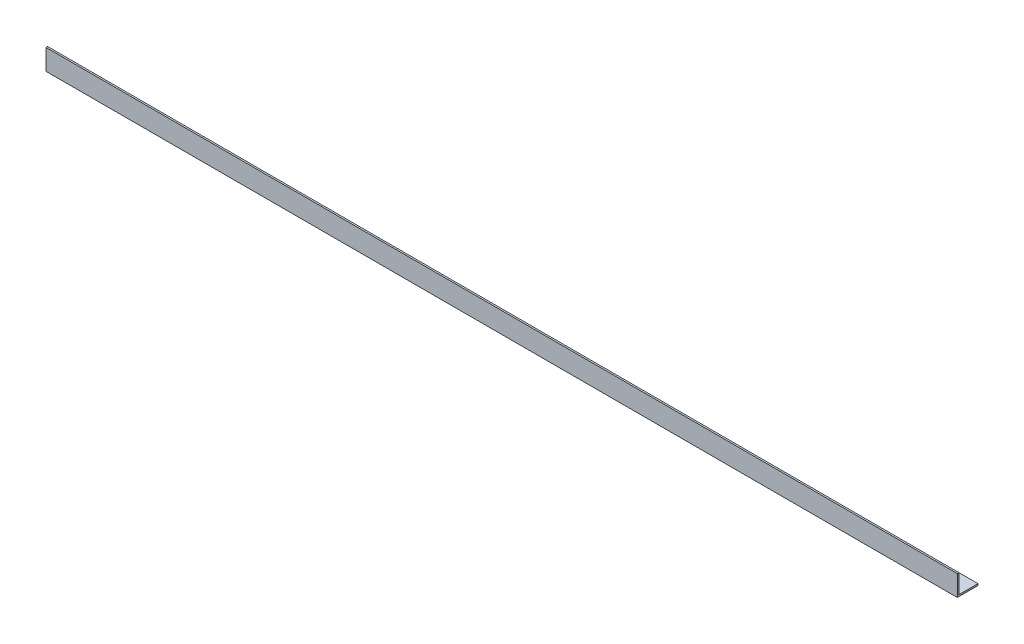
ISO-10303-21;
HEADER;
FILE_DESCRIPTION(('STEP AP214'),'2;1');
FILE_NAME('part.step','',(''),(''),'','','');
FILE_SCHEMA(('AUTOMOTIVE_DESIGN { 1 0 10303 214 1 1 1 1 }'));
ENDSEC;
DATA;
#1=APPLICATION_CONTEXT('core data for automotive mechanical design processes');
#2=APPLICATION_PROTOCOL_DEFINITION('international standard','automotive_design',2000,#1);
#3=PRODUCT_CONTEXT('',#1,'mechanical');
#4=PRODUCT('Part','Part','',(#3));
#5=PRODUCT_RELATED_PRODUCT_CATEGORY('part','',(#4));
#6=PRODUCT_DEFINITION_FORMATION('','',#4);
#7=PRODUCT_DEFINITION_CONTEXT('part definition',#1,'design');
#8=PRODUCT_DEFINITION('design','',#6,#7);
#9=PRODUCT_DEFINITION_SHAPE('','',#8);
#10=(LENGTH_UNIT() NAMED_UNIT(*) SI_UNIT(.MILLI.,.METRE.));
#11=(NAMED_UNIT(*) PLANE_ANGLE_UNIT() SI_UNIT($,.RADIAN.));
#12=(NAMED_UNIT(*) SI_UNIT($,.STERADIAN.) SOLID_ANGLE_UNIT());
#13=UNCERTAINTY_MEASURE_WITH_UNIT(LENGTH_MEASURE(1.E-05),#10,'distance_accuracy_value','');
#14=(GEOMETRIC_REPRESENTATION_CONTEXT(3) GLOBAL_UNCERTAINTY_ASSIGNED_CONTEXT((#13)) GLOBAL_UNIT_ASSIGNED_CONTEXT((#10,
#11,#12)) REPRESENTATION_CONTEXT('',''));
#15=CARTESIAN_POINT('',(0.,0.,0.));
#16=DIRECTION('',(0.,0.,1.));
#17=DIRECTION('',(1.,0.,0.));
#18=AXIS2_PLACEMENT_3D('',#15,#16,#17);
#19=CARTESIAN_POINT('',(1660.,0.,0.));
#20=DIRECTION('',(0.,1.,0.));
#21=DIRECTION('',(0.,0.,1.));
#22=AXIS2_PLACEMENT_3D('',#19,#20,#21);
#23=PLANE('',#22);
#24=DIRECTION('',(0.,0.,-1.));
#25=VECTOR('',#24,1.);
#26=CARTESIAN_POINT('',(0.,0.,0.));
#27=LINE('',#26,#25);
#28=CARTESIAN_POINT('',(0.,0.,0.));
#29=VERTEX_POINT('',#28);
#30=CARTESIAN_POINT('',(0.,0.,-37.7));
#31=VERTEX_POINT('',#30);
#32=EDGE_CURVE('E116',#29,#31,#27,.T.);
#33=ORIENTED_EDGE('',*,*,#32,.T.);
#34=DIRECTION('',(-1.,0.,0.));
#35=VECTOR('',#34,1.);
#36=CARTESIAN_POINT('',(1660.,0.,-37.7));
#37=LINE('',#36,#35);
#38=CARTESIAN_POINT('',(1660.,0.,-37.7));
#39=VERTEX_POINT('',#38);
#40=EDGE_CURVE('E11',#39,#31,#37,.T.);
#41=ORIENTED_EDGE('',*,*,#40,.F.);
#42=DIRECTION('',(0.,0.,-1.));
#43=VECTOR('',#42,1.);
#44=CARTESIAN_POINT('',(1660.,0.,0.));
#45=LINE('',#44,#43);
#46=CARTESIAN_POINT('',(1660.,0.,0.));
#47=VERTEX_POINT('',#46);
#48=EDGE_CURVE('E81',#47,#39,#45,.T.);
#49=ORIENTED_EDGE('',*,*,#48,.F.);
#50=DIRECTION('',(-1.,0.,0.));
#51=VECTOR('',#50,1.);
#52=CARTESIAN_POINT('',(1660.,0.,0.));
#53=LINE('',#52,#51);
#54=EDGE_CURVE('E112',#47,#29,#53,.T.);
#55=ORIENTED_EDGE('',*,*,#54,.T.);
#56=EDGE_LOOP('',(#33,#41,#49,#55));
#57=FACE_BOUND('',#56,.T.);
#58=ADVANCED_FACE('F35',(#57),#23,.F.);
#59=CARTESIAN_POINT('',(1660.,3.,-37.7));
#60=DIRECTION('',(0.,0.,-1.));
#61=DIRECTION('',(-1.,0.,0.));
#62=AXIS2_PLACEMENT_3D('',#59,#60,#61);
#63=PLANE('',#62);
#64=DIRECTION('',(0.,-1.,0.));
#65=VECTOR('',#64,1.);
#66=CARTESIAN_POINT('',(0.,3.,-37.7));
#67=LINE('',#66,#65);
#68=CARTESIAN_POINT('',(0.,3.,-37.7));
#69=VERTEX_POINT('',#68);
#70=EDGE_CURVE('E119',#69,#31,#67,.T.);
#71=ORIENTED_EDGE('',*,*,#70,.F.);
#72=DIRECTION('',(-1.,0.,0.));
#73=VECTOR('',#72,1.);
#74=CARTESIAN_POINT('',(1660.,3.,-37.7));
#75=LINE('',#74,#73);
#76=CARTESIAN_POINT('',(1660.,3.,-37.7));
#77=VERTEX_POINT('',#76);
#78=EDGE_CURVE('E43',#77,#69,#75,.T.);
#79=ORIENTED_EDGE('',*,*,#78,.F.);
#80=DIRECTION('',(0.,-1.,0.));
#81=VECTOR('',#80,1.);
#82=CARTESIAN_POINT('',(1660.,3.,-37.7));
#83=LINE('',#82,#81);
#84=EDGE_CURVE('E205',#77,#39,#83,.T.);
#85=ORIENTED_EDGE('',*,*,#84,.T.);
#86=ORIENTED_EDGE('',*,*,#40,.T.);
#87=EDGE_LOOP('',(#71,#79,#85,#86));
#88=FACE_BOUND('',#87,.T.);
#89=ADVANCED_FACE('F137',(#88),#63,.T.);
#90=CARTESIAN_POINT('',(1660.,3.,0.));
#91=DIRECTION('',(0.,1.,0.));
#92=DIRECTION('',(0.,0.,1.));
#93=AXIS2_PLACEMENT_3D('',#90,#91,#92);
#94=PLANE('',#93);
#95=DIRECTION('',(0.,0.,-1.));
#96=VECTOR('',#95,1.);
#97=CARTESIAN_POINT('',(0.,3.,0.));
#98=LINE('',#97,#96);
#99=CARTESIAN_POINT('',(0.,3.,-3.));
#100=VERTEX_POINT('',#99);
#101=EDGE_CURVE('E122',#100,#69,#98,.T.);
#102=ORIENTED_EDGE('',*,*,#101,.F.);
#103=DIRECTION('',(-1.,0.,0.));
#104=VECTOR('',#103,1.);
#105=CARTESIAN_POINT('',(1660.,3.,-3.));
#106=LINE('',#105,#104);
#107=CARTESIAN_POINT('',(1660.,3.,-3.));
#108=VERTEX_POINT('',#107);
#109=EDGE_CURVE('E102',#108,#100,#106,.T.);
#110=ORIENTED_EDGE('',*,*,#109,.F.);
#111=DIRECTION('',(0.,0.,-1.));
#112=VECTOR('',#111,1.);
#113=CARTESIAN_POINT('',(1660.,3.,0.));
#114=LINE('',#113,#112);
#115=EDGE_CURVE('E108',#108,#77,#114,.T.);
#116=ORIENTED_EDGE('',*,*,#115,.T.);
#117=ORIENTED_EDGE('',*,*,#78,.T.);
#118=EDGE_LOOP('',(#102,#110,#116,#117));
#119=FACE_BOUND('',#118,.T.);
#120=ADVANCED_FACE('F134',(#119),#94,.T.);
#121=CARTESIAN_POINT('',(1660.,37.7,-3.));
#122=DIRECTION('',(0.,0.,-1.));
#123=DIRECTION('',(0.,1.,0.));
#124=AXIS2_PLACEMENT_3D('',#121,#122,#123);
#125=PLANE('',#124);
#126=DIRECTION('',(0.,-1.,0.));
#127=VECTOR('',#126,1.);
#128=CARTESIAN_POINT('',(0.,37.7,-3.));
#129=LINE('',#128,#127);
#130=CARTESIAN_POINT('',(0.,37.7,-3.));
#131=VERTEX_POINT('',#130);
#132=EDGE_CURVE('E97',#131,#100,#129,.T.);
#133=ORIENTED_EDGE('',*,*,#132,.F.);
#134=DIRECTION('',(-1.,0.,0.));
#135=VECTOR('',#134,1.);
#136=CARTESIAN_POINT('',(1660.,37.7,-3.));
#137=LINE('',#136,#135);
#138=CARTESIAN_POINT('',(1660.,37.7,-3.));
#139=VERTEX_POINT('',#138);
#140=EDGE_CURVE('E92',#139,#131,#137,.T.);
#141=ORIENTED_EDGE('',*,*,#140,.F.);
#142=DIRECTION('',(0.,-1.,0.));
#143=VECTOR('',#142,1.);
#144=CARTESIAN_POINT('',(1660.,37.7,-3.));
#145=LINE('',#144,#143);
#146=EDGE_CURVE('E95',#139,#108,#145,.T.);
#147=ORIENTED_EDGE('',*,*,#146,.T.);
#148=ORIENTED_EDGE('',*,*,#109,.T.);
#149=EDGE_LOOP('',(#133,#141,#147,#148));
#150=FACE_BOUND('',#149,.T.);
#151=ADVANCED_FACE('F94',(#150),#125,.T.);
#152=CARTESIAN_POINT('',(1660.,37.7,0.));
#153=DIRECTION('',(0.,1.,0.));
#154=DIRECTION('',(0.,0.,1.));
#155=AXIS2_PLACEMENT_3D('',#152,#153,#154);
#156=PLANE('',#155);
#157=DIRECTION('',(0.,0.,-1.));
#158=VECTOR('',#157,1.);
#159=CARTESIAN_POINT('',(0.,37.7,0.));
#160=LINE('',#159,#158);
#161=CARTESIAN_POINT('',(0.,37.7,0.));
#162=VERTEX_POINT('',#161);
#163=EDGE_CURVE('E126',#162,#131,#160,.T.);
#164=ORIENTED_EDGE('',*,*,#163,.F.);
#165=DIRECTION('',(-1.,0.,0.));
#166=VECTOR('',#165,1.);
#167=CARTESIAN_POINT('',(1660.,37.7,0.));
#168=LINE('',#167,#166);
#169=CARTESIAN_POINT('',(1660.,37.7,0.));
#170=VERTEX_POINT('',#169);
#171=EDGE_CURVE('E72',#170,#162,#168,.T.);
#172=ORIENTED_EDGE('',*,*,#171,.F.);
#173=DIRECTION('',(0.,0.,-1.));
#174=VECTOR('',#173,1.);
#175=CARTESIAN_POINT('',(1660.,37.7,0.));
#176=LINE('',#175,#174);
#177=EDGE_CURVE('E106',#170,#139,#176,.T.);
#178=ORIENTED_EDGE('',*,*,#177,.T.);
#179=ORIENTED_EDGE('',*,*,#140,.T.);
#180=EDGE_LOOP('',(#164,#172,#178,#179));
#181=FACE_BOUND('',#180,.T.);
#182=ADVANCED_FACE('F110',(#181),#156,.T.);
#183=CARTESIAN_POINT('',(1660.,37.7,0.));
#184=DIRECTION('',(0.,0.,-1.));
#185=DIRECTION('',(0.,1.,0.));
#186=AXIS2_PLACEMENT_3D('',#183,#184,#185);
#187=PLANE('',#186);
#188=DIRECTION('',(0.,-1.,0.));
#189=VECTOR('',#188,1.);
#190=CARTESIAN_POINT('',(0.,37.7,0.));
#191=LINE('',#190,#189);
#192=EDGE_CURVE('E75',#162,#29,#191,.T.);
#193=ORIENTED_EDGE('',*,*,#192,.T.);
#194=ORIENTED_EDGE('',*,*,#54,.F.);
#195=DIRECTION('',(0.,-1.,0.));
#196=VECTOR('',#195,1.);
#197=CARTESIAN_POINT('',(1660.,37.7,0.));
#198=LINE('',#197,#196);
#199=EDGE_CURVE('E51',#170,#47,#198,.T.);
#200=ORIENTED_EDGE('',*,*,#199,.F.);
#201=ORIENTED_EDGE('',*,*,#171,.T.);
#202=EDGE_LOOP('',(#193,#194,#200,#201));
#203=FACE_BOUND('',#202,.T.);
#204=ADVANCED_FACE('F142',(#203),#187,.F.);
#205=CARTESIAN_POINT('',(1660.,0.,0.));
#206=DIRECTION('',(-1.,0.,0.));
#207=DIRECTION('',(0.,0.,1.));
#208=AXIS2_PLACEMENT_3D('',#205,#206,#207);
#209=PLANE('',#208);
#210=ORIENTED_EDGE('',*,*,#48,.T.);
#211=ORIENTED_EDGE('',*,*,#84,.F.);
#212=ORIENTED_EDGE('',*,*,#115,.F.);
#213=ORIENTED_EDGE('',*,*,#146,.F.);
#214=ORIENTED_EDGE('',*,*,#177,.F.);
#215=ORIENTED_EDGE('',*,*,#199,.T.);
#216=EDGE_LOOP('',(#210,#211,#212,#213,#214,#215));
#217=FACE_BOUND('',#216,.T.);
#218=ADVANCED_FACE('F105',(#217),#209,.F.);
#219=CARTESIAN_POINT('',(0.,0.,0.));
#220=DIRECTION('',(-1.,0.,0.));
#221=DIRECTION('',(0.,0.,1.));
#222=AXIS2_PLACEMENT_3D('',#219,#220,#221);
#223=PLANE('',#222);
#224=ORIENTED_EDGE('',*,*,#32,.F.);
#225=ORIENTED_EDGE('',*,*,#192,.F.);
#226=ORIENTED_EDGE('',*,*,#163,.T.);
#227=ORIENTED_EDGE('',*,*,#132,.T.);
#228=ORIENTED_EDGE('',*,*,#101,.T.);
#229=ORIENTED_EDGE('',*,*,#70,.T.);
#230=EDGE_LOOP('',(#224,#225,#226,#227,#228,#229));
#231=FACE_BOUND('',#230,.T.);
#232=ADVANCED_FACE('F140',(#231),#223,.T.);
#233=CLOSED_SHELL('',(#58,#89,#120,#151,#182,#204,#218,#232));
#234=MANIFOLD_SOLID_BREP('B2',#233);
#235=ADVANCED_BREP_SHAPE_REPRESENTATION('',(#18,#234),#14);
#236=SHAPE_DEFINITION_REPRESENTATION(#9,#235);
ENDSEC;
END-ISO-10303-21;
